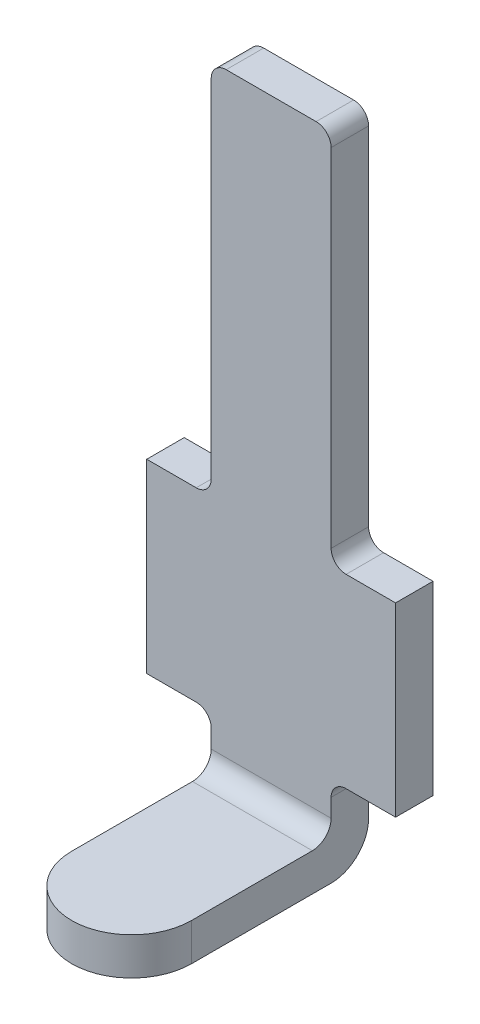
ISO-10303-21;
HEADER;
FILE_DESCRIPTION(('STEP AP214'),'2;1');
FILE_NAME('part.step','',(''),(''),'','','');
FILE_SCHEMA(('AUTOMOTIVE_DESIGN { 1 0 10303 214 1 1 1 1 }'));
ENDSEC;
DATA;
#1=APPLICATION_CONTEXT('core data for automotive mechanical design processes');
#2=APPLICATION_PROTOCOL_DEFINITION('international standard','automotive_design',2000,#1);
#3=PRODUCT_CONTEXT('',#1,'mechanical');
#4=PRODUCT('Part','Part','',(#3));
#5=PRODUCT_RELATED_PRODUCT_CATEGORY('part','',(#4));
#6=PRODUCT_DEFINITION_FORMATION('','',#4);
#7=PRODUCT_DEFINITION_CONTEXT('part definition',#1,'design');
#8=PRODUCT_DEFINITION('design','',#6,#7);
#9=PRODUCT_DEFINITION_SHAPE('','',#8);
#10=(LENGTH_UNIT() NAMED_UNIT(*) SI_UNIT(.MILLI.,.METRE.));
#11=(NAMED_UNIT(*) PLANE_ANGLE_UNIT() SI_UNIT($,.RADIAN.));
#12=(NAMED_UNIT(*) SI_UNIT($,.STERADIAN.) SOLID_ANGLE_UNIT());
#13=UNCERTAINTY_MEASURE_WITH_UNIT(LENGTH_MEASURE(1.E-05),#10,'distance_accuracy_value','');
#14=(GEOMETRIC_REPRESENTATION_CONTEXT(3) GLOBAL_UNCERTAINTY_ASSIGNED_CONTEXT((#13)) GLOBAL_UNIT_ASSIGNED_CONTEXT((#10,
#11,#12)) REPRESENTATION_CONTEXT('',''));
#15=CARTESIAN_POINT('',(0.,0.,0.));
#16=DIRECTION('',(0.,0.,1.));
#17=DIRECTION('',(1.,0.,0.));
#18=AXIS2_PLACEMENT_3D('',#15,#16,#17);
#19=CARTESIAN_POINT('',(-6.85,0.0459658151929143,0.749000000000012));
#20=DIRECTION('',(0.,0.,-1.));
#21=DIRECTION('',(-1.,0.,0.));
#22=AXIS2_PLACEMENT_3D('',#19,#20,#21);
#23=CYLINDRICAL_SURFACE('',#22,0.1);
#24=CARTESIAN_POINT('',(-6.85,0.0459658151929143,0.498999999999983));
#25=DIRECTION('',(0.,0.,1.));
#26=DIRECTION('',(1.,0.,0.));
#27=AXIS2_PLACEMENT_3D('',#24,#25,#26);
#28=CIRCLE('',#27,0.1);
#29=CARTESIAN_POINT('',(-6.75,0.0459658151929143,0.498999999999983));
#30=VERTEX_POINT('',#29);
#31=CARTESIAN_POINT('',(-6.85,0.145965815192914,0.499000000000012));
#32=VERTEX_POINT('',#31);
#33=EDGE_CURVE('E382',#30,#32,#28,.T.);
#34=ORIENTED_EDGE('',*,*,#33,.F.);
#35=DIRECTION('',(0.,0.,-1.));
#36=VECTOR('',#35,1.);
#37=CARTESIAN_POINT('',(-6.75,0.0459658151929143,0.499000000000012));
#38=LINE('',#37,#36);
#39=CARTESIAN_POINT('',(-6.75,0.0459658151929143,0.748999999999983));
#40=VERTEX_POINT('',#39);
#41=EDGE_CURVE('E383',#40,#30,#38,.T.);
#42=ORIENTED_EDGE('',*,*,#41,.F.);
#43=CARTESIAN_POINT('',(-6.85,0.0459658151929143,0.748999999999983));
#44=DIRECTION('',(0.,0.,-1.));
#45=DIRECTION('',(-1.,0.,0.));
#46=AXIS2_PLACEMENT_3D('',#43,#44,#45);
#47=CIRCLE('',#46,0.1);
#48=CARTESIAN_POINT('',(-6.85,0.145965815192914,0.749000000000012));
#49=VERTEX_POINT('',#48);
#50=EDGE_CURVE('E332',#49,#40,#47,.T.);
#51=ORIENTED_EDGE('',*,*,#50,.F.);
#52=DIRECTION('',(0.,0.,1.));
#53=VECTOR('',#52,1.);
#54=CARTESIAN_POINT('',(-6.85,0.145965815192914,0.748999999999983));
#55=LINE('',#54,#53);
#56=EDGE_CURVE('E305',#32,#49,#55,.T.);
#57=ORIENTED_EDGE('',*,*,#56,.F.);
#58=EDGE_LOOP('',(#34,#42,#51,#57));
#59=FACE_BOUND('',#58,.T.);
#60=ADVANCED_FACE('F16',(#59),#23,.F.);
#61=CARTESIAN_POINT('',(-5.85,0.0459658151929143,0.748999999999984));
#62=DIRECTION('',(0.,0.,1.));
#63=DIRECTION('',(1.,0.,0.));
#64=AXIS2_PLACEMENT_3D('',#61,#62,#63);
#65=CYLINDRICAL_SURFACE('',#64,0.1);
#66=CARTESIAN_POINT('',(-5.85,0.0459658151929143,0.498999999999984));
#67=DIRECTION('',(0.,0.,1.));
#68=DIRECTION('',(1.,0.,0.));
#69=AXIS2_PLACEMENT_3D('',#66,#67,#68);
#70=CIRCLE('',#69,0.1);
#71=CARTESIAN_POINT('',(-5.85,0.145965815192914,0.499000000000013));
#72=VERTEX_POINT('',#71);
#73=CARTESIAN_POINT('',(-5.95,0.0459658151929143,0.498999999999984));
#74=VERTEX_POINT('',#73);
#75=EDGE_CURVE('E330',#72,#74,#70,.T.);
#76=ORIENTED_EDGE('',*,*,#75,.F.);
#77=DIRECTION('',(0.,0.,-1.));
#78=VECTOR('',#77,1.);
#79=CARTESIAN_POINT('',(-5.85,0.145965815192914,0.749000000000013));
#80=LINE('',#79,#78);
#81=CARTESIAN_POINT('',(-5.85,0.145965815192914,0.749000000000013));
#82=VERTEX_POINT('',#81);
#83=EDGE_CURVE('E27',#82,#72,#80,.T.);
#84=ORIENTED_EDGE('',*,*,#83,.F.);
#85=CARTESIAN_POINT('',(-5.85,0.0459658151929143,0.748999999999984));
#86=DIRECTION('',(0.,0.,-1.));
#87=DIRECTION('',(-1.,0.,0.));
#88=AXIS2_PLACEMENT_3D('',#85,#86,#87);
#89=CIRCLE('',#88,0.1);
#90=CARTESIAN_POINT('',(-5.95,0.0459658151929143,0.748999999999984));
#91=VERTEX_POINT('',#90);
#92=EDGE_CURVE('E275',#91,#82,#89,.T.);
#93=ORIENTED_EDGE('',*,*,#92,.F.);
#94=DIRECTION('',(0.,0.,1.));
#95=VECTOR('',#94,1.);
#96=CARTESIAN_POINT('',(-5.95,0.0459658151929143,0.748999999999984));
#97=LINE('',#96,#95);
#98=EDGE_CURVE('E454',#74,#91,#97,.T.);
#99=ORIENTED_EDGE('',*,*,#98,.F.);
#100=EDGE_LOOP('',(#76,#84,#93,#99));
#101=FACE_BOUND('',#100,.T.);
#102=ADVANCED_FACE('F453',(#101),#65,.F.);
#103=CARTESIAN_POINT('',(-6.85,1.48437551370885,0.748999999999983));
#104=DIRECTION('',(0.,0.,1.));
#105=DIRECTION('',(1.,0.,0.));
#106=AXIS2_PLACEMENT_3D('',#103,#104,#105);
#107=CYLINDRICAL_SURFACE('',#106,0.1);
#108=CARTESIAN_POINT('',(-6.85,1.48437551370885,0.498999999999983));
#109=DIRECTION('',(0.,0.,1.));
#110=DIRECTION('',(1.,0.,0.));
#111=AXIS2_PLACEMENT_3D('',#108,#109,#110);
#112=CIRCLE('',#111,0.1);
#113=CARTESIAN_POINT('',(-6.85,1.38437551370885,0.499000000000012));
#114=VERTEX_POINT('',#113);
#115=CARTESIAN_POINT('',(-6.75,1.48437551370885,0.498999999999983));
#116=VERTEX_POINT('',#115);
#117=EDGE_CURVE('E416',#114,#116,#112,.T.);
#118=ORIENTED_EDGE('',*,*,#117,.F.);
#119=DIRECTION('',(0.,0.,-1.));
#120=VECTOR('',#119,1.);
#121=CARTESIAN_POINT('',(-6.85,1.38437551370885,0.749000000000012));
#122=LINE('',#121,#120);
#123=CARTESIAN_POINT('',(-6.85,1.38437551370885,0.749000000000012));
#124=VERTEX_POINT('',#123);
#125=EDGE_CURVE('E42',#124,#114,#122,.T.);
#126=ORIENTED_EDGE('',*,*,#125,.F.);
#127=CARTESIAN_POINT('',(-6.85,1.48437551370885,0.748999999999983));
#128=DIRECTION('',(0.,0.,-1.));
#129=DIRECTION('',(-1.,0.,0.));
#130=AXIS2_PLACEMENT_3D('',#127,#128,#129);
#131=CIRCLE('',#130,0.1);
#132=CARTESIAN_POINT('',(-6.75,1.48437551370885,0.748999999999983));
#133=VERTEX_POINT('',#132);
#134=EDGE_CURVE('E367',#133,#124,#131,.T.);
#135=ORIENTED_EDGE('',*,*,#134,.F.);
#136=DIRECTION('',(0.,0.,1.));
#137=VECTOR('',#136,1.);
#138=CARTESIAN_POINT('',(-6.75,1.48437551370885,0.748999999999983));
#139=LINE('',#138,#137);
#140=EDGE_CURVE('E394',#116,#133,#139,.T.);
#141=ORIENTED_EDGE('',*,*,#140,.F.);
#142=EDGE_LOOP('',(#118,#126,#135,#141));
#143=FACE_BOUND('',#142,.T.);
#144=ADVANCED_FACE('F515',(#143),#107,.F.);
#145=CARTESIAN_POINT('',(-5.85,1.48437551370885,0.749000000000014));
#146=DIRECTION('',(0.,0.,-1.));
#147=DIRECTION('',(-1.,0.,0.));
#148=AXIS2_PLACEMENT_3D('',#145,#146,#147);
#149=CYLINDRICAL_SURFACE('',#148,0.1);
#150=CARTESIAN_POINT('',(-5.85,1.48437551370885,0.498999999999985));
#151=DIRECTION('',(0.,0.,1.));
#152=DIRECTION('',(1.,0.,0.));
#153=AXIS2_PLACEMENT_3D('',#150,#151,#152);
#154=CIRCLE('',#153,0.1);
#155=CARTESIAN_POINT('',(-5.95,1.48437551370885,0.498999999999984));
#156=VERTEX_POINT('',#155);
#157=CARTESIAN_POINT('',(-5.85,1.38437551370885,0.499000000000013));
#158=VERTEX_POINT('',#157);
#159=EDGE_CURVE('E215',#156,#158,#154,.T.);
#160=ORIENTED_EDGE('',*,*,#159,.F.);
#161=DIRECTION('',(0.,0.,-1.));
#162=VECTOR('',#161,1.);
#163=CARTESIAN_POINT('',(-5.95,1.48437551370885,0.498999999999984));
#164=LINE('',#163,#162);
#165=CARTESIAN_POINT('',(-5.95,1.48437551370885,0.748999999999984));
#166=VERTEX_POINT('',#165);
#167=EDGE_CURVE('E219',#166,#156,#164,.T.);
#168=ORIENTED_EDGE('',*,*,#167,.F.);
#169=CARTESIAN_POINT('',(-5.85,1.48437551370885,0.748999999999984));
#170=DIRECTION('',(0.,0.,-1.));
#171=DIRECTION('',(-1.,0.,0.));
#172=AXIS2_PLACEMENT_3D('',#169,#170,#171);
#173=CIRCLE('',#172,0.1);
#174=CARTESIAN_POINT('',(-5.85,1.38437551370885,0.749000000000014));
#175=VERTEX_POINT('',#174);
#176=EDGE_CURVE('E272',#175,#166,#173,.T.);
#177=ORIENTED_EDGE('',*,*,#176,.F.);
#178=DIRECTION('',(0.,0.,1.));
#179=VECTOR('',#178,1.);
#180=CARTESIAN_POINT('',(-5.85,1.38437551370885,0.748999999999984));
#181=LINE('',#180,#179);
#182=EDGE_CURVE('E221',#158,#175,#181,.T.);
#183=ORIENTED_EDGE('',*,*,#182,.F.);
#184=EDGE_LOOP('',(#160,#168,#177,#183));
#185=FACE_BOUND('',#184,.T.);
#186=ADVANCED_FACE('F217',(#185),#149,.F.);
#187=CARTESIAN_POINT('',(-6.65,3.8,0.748999999999983));
#188=DIRECTION('',(0.,0.,-1.));
#189=DIRECTION('',(-1.,0.,0.));
#190=AXIS2_PLACEMENT_3D('',#187,#188,#189);
#191=CYLINDRICAL_SURFACE('',#190,0.1);
#192=CARTESIAN_POINT('',(-6.65,3.8,0.498999999999984));
#193=DIRECTION('',(0.,0.,-1.));
#194=DIRECTION('',(1.,0.,0.));
#195=AXIS2_PLACEMENT_3D('',#192,#193,#194);
#196=CIRCLE('',#195,0.1);
#197=CARTESIAN_POINT('',(-6.75,3.8,0.498999999999984));
#198=VERTEX_POINT('',#197);
#199=CARTESIAN_POINT('',(-6.65,3.9,0.498999999999984));
#200=VERTEX_POINT('',#199);
#201=EDGE_CURVE('E420',#198,#200,#196,.T.);
#202=ORIENTED_EDGE('',*,*,#201,.F.);
#203=DIRECTION('',(0.,0.,-1.));
#204=VECTOR('',#203,1.);
#205=CARTESIAN_POINT('',(-6.75,3.8,0.498999999999984));
#206=LINE('',#205,#204);
#207=CARTESIAN_POINT('',(-6.75,3.8,0.748999999999983));
#208=VERTEX_POINT('',#207);
#209=EDGE_CURVE('E395',#208,#198,#206,.T.);
#210=ORIENTED_EDGE('',*,*,#209,.F.);
#211=CARTESIAN_POINT('',(-6.65,3.8,0.748999999999983));
#212=DIRECTION('',(0.,0.,1.));
#213=DIRECTION('',(-1.,0.,0.));
#214=AXIS2_PLACEMENT_3D('',#211,#212,#213);
#215=CIRCLE('',#214,0.1);
#216=CARTESIAN_POINT('',(-6.65,3.9,0.748999999999983));
#217=VERTEX_POINT('',#216);
#218=EDGE_CURVE('E289',#217,#208,#215,.T.);
#219=ORIENTED_EDGE('',*,*,#218,.F.);
#220=DIRECTION('',(0.,0.,1.));
#221=VECTOR('',#220,1.);
#222=CARTESIAN_POINT('',(-6.65,3.9,0.748999999999983));
#223=LINE('',#222,#221);
#224=EDGE_CURVE('E320',#200,#217,#223,.T.);
#225=ORIENTED_EDGE('',*,*,#224,.F.);
#226=EDGE_LOOP('',(#202,#210,#219,#225));
#227=FACE_BOUND('',#226,.T.);
#228=ADVANCED_FACE('F563',(#227),#191,.T.);
#229=CARTESIAN_POINT('',(-6.05,3.8,0.748999999999984));
#230=DIRECTION('',(0.,0.,1.));
#231=DIRECTION('',(1.,0.,0.));
#232=AXIS2_PLACEMENT_3D('',#229,#230,#231);
#233=CYLINDRICAL_SURFACE('',#232,0.1);
#234=CARTESIAN_POINT('',(-6.05,3.8,0.498999999999985));
#235=DIRECTION('',(0.,0.,-1.));
#236=DIRECTION('',(1.,0.,0.));
#237=AXIS2_PLACEMENT_3D('',#234,#235,#236);
#238=CIRCLE('',#237,0.1);
#239=CARTESIAN_POINT('',(-6.05,3.9,0.498999999999985));
#240=VERTEX_POINT('',#239);
#241=CARTESIAN_POINT('',(-5.95,3.8,0.498999999999985));
#242=VERTEX_POINT('',#241);
#243=EDGE_CURVE('E228',#240,#242,#238,.T.);
#244=ORIENTED_EDGE('',*,*,#243,.F.);
#245=DIRECTION('',(0.,0.,-1.));
#246=VECTOR('',#245,1.);
#247=CARTESIAN_POINT('',(-6.05,3.9,0.748999999999984));
#248=LINE('',#247,#246);
#249=CARTESIAN_POINT('',(-6.05,3.9,0.748999999999984));
#250=VERTEX_POINT('',#249);
#251=EDGE_CURVE('E363',#250,#240,#248,.T.);
#252=ORIENTED_EDGE('',*,*,#251,.F.);
#253=CARTESIAN_POINT('',(-6.05,3.8,0.748999999999984));
#254=DIRECTION('',(0.,0.,1.));
#255=DIRECTION('',(-1.,0.,0.));
#256=AXIS2_PLACEMENT_3D('',#253,#254,#255);
#257=CIRCLE('',#256,0.1);
#258=CARTESIAN_POINT('',(-5.95,3.8,0.748999999999984));
#259=VERTEX_POINT('',#258);
#260=EDGE_CURVE('E323',#259,#250,#257,.T.);
#261=ORIENTED_EDGE('',*,*,#260,.F.);
#262=DIRECTION('',(0.,0.,1.));
#263=VECTOR('',#262,1.);
#264=CARTESIAN_POINT('',(-5.95,3.8,0.748999999999984));
#265=LINE('',#264,#263);
#266=EDGE_CURVE('E244',#242,#259,#265,.T.);
#267=ORIENTED_EDGE('',*,*,#266,.F.);
#268=EDGE_LOOP('',(#244,#252,#261,#267));
#269=FACE_BOUND('',#268,.T.);
#270=ADVANCED_FACE('F18',(#269),#233,.T.);
#271=CARTESIAN_POINT('',(-5.52,0.,1.00308650274883E-13));
#272=DIRECTION('',(-1.,0.,0.));
#273=DIRECTION('',(0.,0.,1.));
#274=AXIS2_PLACEMENT_3D('',#271,#272,#273);
#275=PLANE('',#274);
#276=DIRECTION('',(0.,0.,-1.));
#277=VECTOR('',#276,1.);
#278=CARTESIAN_POINT('',(-5.52,1.38437551370885,0.749000000000014));
#279=LINE('',#278,#277);
#280=CARTESIAN_POINT('',(-5.52,1.38437551370885,0.749000000000014));
#281=VERTEX_POINT('',#280);
#282=CARTESIAN_POINT('',(-5.52,1.38437551370885,0.499000000000014));
#283=VERTEX_POINT('',#282);
#284=EDGE_CURVE('E292',#281,#283,#279,.T.);
#285=ORIENTED_EDGE('',*,*,#284,.F.);
#286=DIRECTION('',(0.,-1.,0.));
#287=VECTOR('',#286,1.);
#288=CARTESIAN_POINT('',(-5.52,1.38437551370885,0.749000000000014));
#289=LINE('',#288,#287);
#290=CARTESIAN_POINT('',(-5.52,0.145965815192914,0.749000000000014));
#291=VERTEX_POINT('',#290);
#292=EDGE_CURVE('E259',#281,#291,#289,.T.);
#293=ORIENTED_EDGE('',*,*,#292,.T.);
#294=DIRECTION('',(0.,0.,-1.));
#295=VECTOR('',#294,1.);
#296=CARTESIAN_POINT('',(-5.52,0.145965815192914,0.749000000000014));
#297=LINE('',#296,#295);
#298=CARTESIAN_POINT('',(-5.52,0.145965815192914,0.499000000000014));
#299=VERTEX_POINT('',#298);
#300=EDGE_CURVE('E11',#291,#299,#297,.T.);
#301=ORIENTED_EDGE('',*,*,#300,.T.);
#302=DIRECTION('',(0.,-1.,0.));
#303=VECTOR('',#302,1.);
#304=CARTESIAN_POINT('',(-5.52,1.38437551370885,0.499000000000014));
#305=LINE('',#304,#303);
#306=EDGE_CURVE('E331',#283,#299,#305,.T.);
#307=ORIENTED_EDGE('',*,*,#306,.F.);
#308=EDGE_LOOP('',(#285,#293,#301,#307));
#309=FACE_BOUND('',#308,.T.);
#310=ADVANCED_FACE('F447',(#309),#275,.F.);
#311=CARTESIAN_POINT('',(-7.18,0.145965815192914,0.749000000000011));
#312=DIRECTION('',(0.,-1.,0.));
#313=DIRECTION('',(0.,0.,-1.));
#314=AXIS2_PLACEMENT_3D('',#311,#312,#313);
#315=PLANE('',#314);
#316=DIRECTION('',(1.,0.,0.));
#317=VECTOR('',#316,1.);
#318=CARTESIAN_POINT('',(-7.18,0.145965815192914,0.749000000000011));
#319=LINE('',#318,#317);
#320=EDGE_CURVE('E263',#82,#291,#319,.T.);
#321=ORIENTED_EDGE('',*,*,#320,.F.);
#322=ORIENTED_EDGE('',*,*,#83,.T.);
#323=DIRECTION('',(1.,0.,0.));
#324=VECTOR('',#323,1.);
#325=CARTESIAN_POINT('',(-7.18,0.145965815192914,0.499000000000011));
#326=LINE('',#325,#324);
#327=EDGE_CURVE('E326',#72,#299,#326,.T.);
#328=ORIENTED_EDGE('',*,*,#327,.T.);
#329=ORIENTED_EDGE('',*,*,#300,.F.);
#330=EDGE_LOOP('',(#321,#322,#328,#329));
#331=FACE_BOUND('',#330,.T.);
#332=ADVANCED_FACE('F449',(#331),#315,.T.);
#333=CARTESIAN_POINT('',(-7.18,1.38437551370885,0.749000000000012));
#334=DIRECTION('',(0.,-1.,0.));
#335=DIRECTION('',(0.,0.,-1.));
#336=AXIS2_PLACEMENT_3D('',#333,#334,#335);
#337=PLANE('',#336);
#338=DIRECTION('',(1.,0.,0.));
#339=VECTOR('',#338,1.);
#340=CARTESIAN_POINT('',(-7.18,1.38437551370885,0.499000000000011));
#341=LINE('',#340,#339);
#342=EDGE_CURVE('E227',#158,#283,#341,.T.);
#343=ORIENTED_EDGE('',*,*,#342,.F.);
#344=ORIENTED_EDGE('',*,*,#182,.T.);
#345=DIRECTION('',(1.,0.,0.));
#346=VECTOR('',#345,1.);
#347=CARTESIAN_POINT('',(-7.18,1.38437551370885,0.749000000000012));
#348=LINE('',#347,#346);
#349=EDGE_CURVE('E262',#175,#281,#348,.T.);
#350=ORIENTED_EDGE('',*,*,#349,.T.);
#351=ORIENTED_EDGE('',*,*,#284,.T.);
#352=EDGE_LOOP('',(#343,#344,#350,#351));
#353=FACE_BOUND('',#352,.T.);
#354=ADVANCED_FACE('F444',(#353),#337,.F.);
#355=CARTESIAN_POINT('',(-7.18,1.38437551370885,0.749000000000012));
#356=DIRECTION('',(0.,-1.,0.));
#357=DIRECTION('',(0.,0.,-1.));
#358=AXIS2_PLACEMENT_3D('',#355,#356,#357);
#359=PLANE('',#358);
#360=DIRECTION('',(1.,0.,0.));
#361=VECTOR('',#360,1.);
#362=CARTESIAN_POINT('',(-7.18,1.38437551370885,0.749000000000012));
#363=LINE('',#362,#361);
#364=CARTESIAN_POINT('',(-7.18,1.38437551370885,0.749000000000012));
#365=VERTEX_POINT('',#364);
#366=EDGE_CURVE('E364',#365,#124,#363,.T.);
#367=ORIENTED_EDGE('',*,*,#366,.T.);
#368=ORIENTED_EDGE('',*,*,#125,.T.);
#369=DIRECTION('',(1.,0.,0.));
#370=VECTOR('',#369,1.);
#371=CARTESIAN_POINT('',(-7.18,1.38437551370885,0.499000000000011));
#372=LINE('',#371,#370);
#373=CARTESIAN_POINT('',(-7.18,1.38437551370885,0.499000000000011));
#374=VERTEX_POINT('',#373);
#375=EDGE_CURVE('E303',#374,#114,#372,.T.);
#376=ORIENTED_EDGE('',*,*,#375,.F.);
#377=DIRECTION('',(0.,0.,-1.));
#378=VECTOR('',#377,1.);
#379=CARTESIAN_POINT('',(-7.18,1.38437551370885,0.749000000000012));
#380=LINE('',#379,#378);
#381=EDGE_CURVE('E408',#365,#374,#380,.T.);
#382=ORIENTED_EDGE('',*,*,#381,.F.);
#383=EDGE_LOOP('',(#367,#368,#376,#382));
#384=FACE_BOUND('',#383,.T.);
#385=ADVANCED_FACE('F498',(#384),#359,.F.);
#386=CARTESIAN_POINT('',(-7.18,0.145965815192914,0.749000000000011));
#387=DIRECTION('',(0.,-1.,0.));
#388=DIRECTION('',(0.,0.,-1.));
#389=AXIS2_PLACEMENT_3D('',#386,#387,#388);
#390=PLANE('',#389);
#391=DIRECTION('',(1.,0.,0.));
#392=VECTOR('',#391,1.);
#393=CARTESIAN_POINT('',(-7.18,0.145965815192914,0.499000000000011));
#394=LINE('',#393,#392);
#395=CARTESIAN_POINT('',(-7.18,0.145965815192914,0.499000000000011));
#396=VERTEX_POINT('',#395);
#397=EDGE_CURVE('E304',#396,#32,#394,.T.);
#398=ORIENTED_EDGE('',*,*,#397,.T.);
#399=ORIENTED_EDGE('',*,*,#56,.T.);
#400=DIRECTION('',(1.,0.,0.));
#401=VECTOR('',#400,1.);
#402=CARTESIAN_POINT('',(-7.18,0.145965815192914,0.749000000000011));
#403=LINE('',#402,#401);
#404=CARTESIAN_POINT('',(-7.18,0.145965815192914,0.749000000000011));
#405=VERTEX_POINT('',#404);
#406=EDGE_CURVE('E337',#405,#49,#403,.T.);
#407=ORIENTED_EDGE('',*,*,#406,.F.);
#408=DIRECTION('',(0.,0.,-1.));
#409=VECTOR('',#408,1.);
#410=CARTESIAN_POINT('',(-7.18,0.145965815192914,0.749000000000011));
#411=LINE('',#410,#409);
#412=EDGE_CURVE('E308',#405,#396,#411,.T.);
#413=ORIENTED_EDGE('',*,*,#412,.T.);
#414=EDGE_LOOP('',(#398,#399,#407,#413));
#415=FACE_BOUND('',#414,.T.);
#416=ADVANCED_FACE('F488',(#415),#390,.T.);
#417=CARTESIAN_POINT('',(-7.18,0.,0.));
#418=DIRECTION('',(-1.,0.,0.));
#419=DIRECTION('',(0.,0.,1.));
#420=AXIS2_PLACEMENT_3D('',#417,#418,#419);
#421=PLANE('',#420);
#422=ORIENTED_EDGE('',*,*,#381,.T.);
#423=DIRECTION('',(0.,-1.,0.));
#424=VECTOR('',#423,1.);
#425=CARTESIAN_POINT('',(-7.18,1.38437551370885,0.499000000000011));
#426=LINE('',#425,#424);
#427=EDGE_CURVE('E299',#374,#396,#426,.T.);
#428=ORIENTED_EDGE('',*,*,#427,.T.);
#429=ORIENTED_EDGE('',*,*,#412,.F.);
#430=DIRECTION('',(0.,-1.,0.));
#431=VECTOR('',#430,1.);
#432=CARTESIAN_POINT('',(-7.18,1.38437551370885,0.749000000000012));
#433=LINE('',#432,#431);
#434=EDGE_CURVE('E340',#365,#405,#433,.T.);
#435=ORIENTED_EDGE('',*,*,#434,.F.);
#436=EDGE_LOOP('',(#422,#428,#429,#435));
#437=FACE_BOUND('',#436,.T.);
#438=ADVANCED_FACE('F492',(#437),#421,.T.);
#439=CARTESIAN_POINT('',(-6.35,-0.2,1.68));
#440=DIRECTION('',(0.,-1.,0.));
#441=DIRECTION('',(0.,0.,-1.));
#442=AXIS2_PLACEMENT_3D('',#439,#440,#441);
#443=CYLINDRICAL_SURFACE('',#442,0.4);
#444=DIRECTION('',(0.,-1.,0.));
#445=VECTOR('',#444,1.);
#446=CARTESIAN_POINT('',(-5.95,-0.2,1.68));
#447=LINE('',#446,#445);
#448=CARTESIAN_POINT('',(-5.95,-0.2,1.68));
#449=VERTEX_POINT('',#448);
#450=CARTESIAN_POINT('',(-5.95,-0.45,1.68));
#451=VERTEX_POINT('',#450);
#452=EDGE_CURVE('E191',#449,#451,#447,.T.);
#453=ORIENTED_EDGE('',*,*,#452,.F.);
#454=CARTESIAN_POINT('',(-6.35,-0.2,1.68));
#455=DIRECTION('',(0.,1.,0.));
#456=DIRECTION('',(0.,0.,-1.));
#457=AXIS2_PLACEMENT_3D('',#454,#455,#456);
#458=CIRCLE('',#457,0.4);
#459=CARTESIAN_POINT('',(-6.75,-0.2,1.68));
#460=VERTEX_POINT('',#459);
#461=EDGE_CURVE('E297',#460,#449,#458,.T.);
#462=ORIENTED_EDGE('',*,*,#461,.F.);
#463=DIRECTION('',(0.,1.,0.));
#464=VECTOR('',#463,1.);
#465=CARTESIAN_POINT('',(-6.75,-0.2,1.68));
#466=LINE('',#465,#464);
#467=CARTESIAN_POINT('',(-6.75,-0.45,1.68));
#468=VERTEX_POINT('',#467);
#469=EDGE_CURVE('E203',#468,#460,#466,.T.);
#470=ORIENTED_EDGE('',*,*,#469,.F.);
#471=CARTESIAN_POINT('',(-6.35,-0.45,1.68));
#472=DIRECTION('',(0.,-1.,0.));
#473=DIRECTION('',(0.,0.,1.));
#474=AXIS2_PLACEMENT_3D('',#471,#472,#473);
#475=CIRCLE('',#474,0.4);
#476=EDGE_CURVE('E255',#451,#468,#475,.T.);
#477=ORIENTED_EDGE('',*,*,#476,.F.);
#478=EDGE_LOOP('',(#453,#462,#470,#477));
#479=FACE_BOUND('',#478,.T.);
#480=ADVANCED_FACE('F535',(#479),#443,.T.);
#481=CARTESIAN_POINT('',(-6.75,-0.2,0.748999999999983));
#482=DIRECTION('',(-1.,0.,0.));
#483=DIRECTION('',(0.,0.,1.));
#484=AXIS2_PLACEMENT_3D('',#481,#482,#483);
#485=PLANE('',#484);
#486=DIRECTION('',(0.,-1.,0.));
#487=VECTOR('',#486,1.);
#488=CARTESIAN_POINT('',(-6.75,3.9,0.748999999999983));
#489=LINE('',#488,#487);
#490=CARTESIAN_POINT('',(-6.75,-0.0749999999999988,0.748999999999983));
#491=VERTEX_POINT('',#490);
#492=EDGE_CURVE('E336',#40,#491,#489,.T.);
#493=ORIENTED_EDGE('',*,*,#492,.F.);
#494=ORIENTED_EDGE('',*,*,#41,.T.);
#495=DIRECTION('',(0.,1.,0.));
#496=VECTOR('',#495,1.);
#497=CARTESIAN_POINT('',(-6.75,3.9,0.498999999999984));
#498=LINE('',#497,#496);
#499=CARTESIAN_POINT('',(-6.75,-0.2,0.498999999999983));
#500=VERTEX_POINT('',#499);
#501=EDGE_CURVE('E20',#500,#30,#498,.T.);
#502=ORIENTED_EDGE('',*,*,#501,.F.);
#503=CARTESIAN_POINT('',(-6.75,-0.2,0.748999999999983));
#504=DIRECTION('',(1.,0.,0.));
#505=DIRECTION('',(0.,0.,1.));
#506=AXIS2_PLACEMENT_3D('',#503,#504,#505);
#507=CIRCLE('',#506,0.25);
#508=CARTESIAN_POINT('',(-6.75,-0.45,0.748999999999983));
#509=VERTEX_POINT('',#508);
#510=EDGE_CURVE('E359',#509,#500,#507,.T.);
#511=ORIENTED_EDGE('',*,*,#510,.F.);
#512=DIRECTION('',(0.,0.,-1.));
#513=VECTOR('',#512,1.);
#514=CARTESIAN_POINT('',(-6.75,-0.45,0.748999999999983));
#515=LINE('',#514,#513);
#516=EDGE_CURVE('E257',#468,#509,#515,.T.);
#517=ORIENTED_EDGE('',*,*,#516,.F.);
#518=ORIENTED_EDGE('',*,*,#469,.T.);
#519=DIRECTION('',(0.,0.,1.));
#520=VECTOR('',#519,1.);
#521=CARTESIAN_POINT('',(-6.75,-0.2,0.873999999999983));
#522=LINE('',#521,#520);
#523=CARTESIAN_POINT('',(-6.75,-0.2,0.873999999999983));
#524=VERTEX_POINT('',#523);
#525=EDGE_CURVE('E293',#524,#460,#522,.T.);
#526=ORIENTED_EDGE('',*,*,#525,.F.);
#527=CARTESIAN_POINT('',(-6.75,-0.0749999999999988,0.873999999999983));
#528=DIRECTION('',(-1.,0.,0.));
#529=DIRECTION('',(0.,0.,1.));
#530=AXIS2_PLACEMENT_3D('',#527,#528,#529);
#531=CIRCLE('',#530,0.125);
#532=EDGE_CURVE('E309',#491,#524,#531,.T.);
#533=ORIENTED_EDGE('',*,*,#532,.F.);
#534=EDGE_LOOP('',(#493,#494,#502,#511,#517,#518,#526,#533));
#535=FACE_BOUND('',#534,.T.);
#536=ADVANCED_FACE('F481',(#535),#485,.T.);
#537=CARTESIAN_POINT('',(-5.95,-0.2,0.748999999999984));
#538=DIRECTION('',(-1.,0.,0.));
#539=DIRECTION('',(0.,0.,1.));
#540=AXIS2_PLACEMENT_3D('',#537,#538,#539);
#541=PLANE('',#540);
#542=DIRECTION('',(0.,1.,0.));
#543=VECTOR('',#542,1.);
#544=CARTESIAN_POINT('',(-5.95,3.9,0.498999999999985));
#545=LINE('',#544,#543);
#546=CARTESIAN_POINT('',(-5.95,-0.2,0.498999999999984));
#547=VERTEX_POINT('',#546);
#548=EDGE_CURVE('E386',#547,#74,#545,.T.);
#549=ORIENTED_EDGE('',*,*,#548,.T.);
#550=ORIENTED_EDGE('',*,*,#98,.T.);
#551=DIRECTION('',(0.,-1.,0.));
#552=VECTOR('',#551,1.);
#553=CARTESIAN_POINT('',(-5.95,3.9,0.748999999999984));
#554=LINE('',#553,#552);
#555=CARTESIAN_POINT('',(-5.95,-0.0749999999999988,0.748999999999984));
#556=VERTEX_POINT('',#555);
#557=EDGE_CURVE('E285',#91,#556,#554,.T.);
#558=ORIENTED_EDGE('',*,*,#557,.T.);
#559=CARTESIAN_POINT('',(-5.95,-0.0749999999999988,0.873999999999984));
#560=DIRECTION('',(-1.,0.,0.));
#561=DIRECTION('',(0.,0.,1.));
#562=AXIS2_PLACEMENT_3D('',#559,#560,#561);
#563=CIRCLE('',#562,0.125);
#564=CARTESIAN_POINT('',(-5.95,-0.2,0.873999999999984));
#565=VERTEX_POINT('',#564);
#566=EDGE_CURVE('E298',#556,#565,#563,.T.);
#567=ORIENTED_EDGE('',*,*,#566,.T.);
#568=DIRECTION('',(0.,0.,1.));
#569=VECTOR('',#568,1.);
#570=CARTESIAN_POINT('',(-5.95,-0.2,0.873999999999984));
#571=LINE('',#570,#569);
#572=EDGE_CURVE('E258',#565,#449,#571,.T.);
#573=ORIENTED_EDGE('',*,*,#572,.T.);
#574=ORIENTED_EDGE('',*,*,#452,.T.);
#575=DIRECTION('',(0.,0.,-1.));
#576=VECTOR('',#575,1.);
#577=CARTESIAN_POINT('',(-5.95,-0.45,0.748999999999984));
#578=LINE('',#577,#576);
#579=CARTESIAN_POINT('',(-5.95,-0.45,0.748999999999984));
#580=VERTEX_POINT('',#579);
#581=EDGE_CURVE('E433',#451,#580,#578,.T.);
#582=ORIENTED_EDGE('',*,*,#581,.T.);
#583=CARTESIAN_POINT('',(-5.95,-0.2,0.748999999999984));
#584=DIRECTION('',(1.,0.,0.));
#585=DIRECTION('',(0.,0.,1.));
#586=AXIS2_PLACEMENT_3D('',#583,#584,#585);
#587=CIRCLE('',#586,0.25);
#588=EDGE_CURVE('E358',#580,#547,#587,.T.);
#589=ORIENTED_EDGE('',*,*,#588,.T.);
#590=EDGE_LOOP('',(#549,#550,#558,#567,#573,#574,#582,#589));
#591=FACE_BOUND('',#590,.T.);
#592=ADVANCED_FACE('F458',(#591),#541,.F.);
#593=CARTESIAN_POINT('',(-5.95,3.9,0.498999999999985));
#594=DIRECTION('',(0.,0.,1.));
#595=DIRECTION('',(1.,0.,0.));
#596=AXIS2_PLACEMENT_3D('',#593,#594,#595);
#597=PLANE('',#596);
#598=DIRECTION('',(-1.,0.,0.));
#599=VECTOR('',#598,1.);
#600=CARTESIAN_POINT('',(-5.95,3.9,0.498999999999985));
#601=LINE('',#600,#599);
#602=EDGE_CURVE('E324',#240,#200,#601,.T.);
#603=ORIENTED_EDGE('',*,*,#602,.F.);
#604=ORIENTED_EDGE('',*,*,#243,.T.);
#605=DIRECTION('',(0.,1.,0.));
#606=VECTOR('',#605,1.);
#607=CARTESIAN_POINT('',(-5.95,3.9,0.498999999999985));
#608=LINE('',#607,#606);
#609=EDGE_CURVE('E234',#156,#242,#608,.T.);
#610=ORIENTED_EDGE('',*,*,#609,.F.);
#611=ORIENTED_EDGE('',*,*,#159,.T.);
#612=ORIENTED_EDGE('',*,*,#342,.T.);
#613=ORIENTED_EDGE('',*,*,#306,.T.);
#614=ORIENTED_EDGE('',*,*,#327,.F.);
#615=ORIENTED_EDGE('',*,*,#75,.T.);
#616=ORIENTED_EDGE('',*,*,#548,.F.);
#617=DIRECTION('',(-1.,0.,0.));
#618=VECTOR('',#617,1.);
#619=CARTESIAN_POINT('',(-5.95,-0.2,0.498999999999984));
#620=LINE('',#619,#618);
#621=EDGE_CURVE('E355',#547,#500,#620,.T.);
#622=ORIENTED_EDGE('',*,*,#621,.T.);
#623=ORIENTED_EDGE('',*,*,#501,.T.);
#624=ORIENTED_EDGE('',*,*,#33,.T.);
#625=ORIENTED_EDGE('',*,*,#397,.F.);
#626=ORIENTED_EDGE('',*,*,#427,.F.);
#627=ORIENTED_EDGE('',*,*,#375,.T.);
#628=ORIENTED_EDGE('',*,*,#117,.T.);
#629=DIRECTION('',(0.,1.,0.));
#630=VECTOR('',#629,1.);
#631=CARTESIAN_POINT('',(-6.75,3.9,0.498999999999984));
#632=LINE('',#631,#630);
#633=EDGE_CURVE('E390',#116,#198,#632,.T.);
#634=ORIENTED_EDGE('',*,*,#633,.T.);
#635=ORIENTED_EDGE('',*,*,#201,.T.);
#636=EDGE_LOOP('',(#603,#604,#610,#611,#612,#613,#614,#615,#616,#622,#623,#624,#625,#626,#627,
#628,#634,#635));
#637=FACE_BOUND('',#636,.T.);
#638=ADVANCED_FACE('F241',(#637),#597,.F.);
#639=CARTESIAN_POINT('',(-5.95,-0.2,0.748999999999984));
#640=DIRECTION('',(-1.,0.,0.));
#641=DIRECTION('',(0.,0.,1.));
#642=AXIS2_PLACEMENT_3D('',#639,#640,#641);
#643=CYLINDRICAL_SURFACE('',#642,0.25);
#644=ORIENTED_EDGE('',*,*,#510,.T.);
#645=ORIENTED_EDGE('',*,*,#621,.F.);
#646=ORIENTED_EDGE('',*,*,#588,.F.);
#647=DIRECTION('',(-1.,0.,0.));
#648=VECTOR('',#647,1.);
#649=CARTESIAN_POINT('',(-5.95,-0.45,0.748999999999984));
#650=LINE('',#649,#648);
#651=EDGE_CURVE('E402',#580,#509,#650,.T.);
#652=ORIENTED_EDGE('',*,*,#651,.T.);
#653=EDGE_LOOP('',(#644,#645,#646,#652));
#654=FACE_BOUND('',#653,.T.);
#655=ADVANCED_FACE('F462',(#654),#643,.T.);
#656=CARTESIAN_POINT('',(-5.95,-0.45,0.748999999999984));
#657=DIRECTION('',(0.,1.,0.));
#658=DIRECTION('',(0.,0.,-1.));
#659=AXIS2_PLACEMENT_3D('',#656,#657,#658);
#660=PLANE('',#659);
#661=ORIENTED_EDGE('',*,*,#476,.T.);
#662=ORIENTED_EDGE('',*,*,#516,.T.);
#663=ORIENTED_EDGE('',*,*,#651,.F.);
#664=ORIENTED_EDGE('',*,*,#581,.F.);
#665=EDGE_LOOP('',(#661,#662,#663,#664));
#666=FACE_BOUND('',#665,.T.);
#667=ADVANCED_FACE('F529',(#666),#660,.F.);
#668=CARTESIAN_POINT('',(-5.95,-0.2,0.873999999999984));
#669=DIRECTION('',(0.,-1.,0.));
#670=DIRECTION('',(0.,0.,-1.));
#671=AXIS2_PLACEMENT_3D('',#668,#669,#670);
#672=PLANE('',#671);
#673=ORIENTED_EDGE('',*,*,#525,.T.);
#674=ORIENTED_EDGE('',*,*,#461,.T.);
#675=ORIENTED_EDGE('',*,*,#572,.F.);
#676=DIRECTION('',(-1.,0.,0.));
#677=VECTOR('',#676,1.);
#678=CARTESIAN_POINT('',(-5.95,-0.2,0.873999999999984));
#679=LINE('',#678,#677);
#680=EDGE_CURVE('E313',#565,#524,#679,.T.);
#681=ORIENTED_EDGE('',*,*,#680,.T.);
#682=EDGE_LOOP('',(#673,#674,#675,#681));
#683=FACE_BOUND('',#682,.T.);
#684=ADVANCED_FACE('F527',(#683),#672,.F.);
#685=CARTESIAN_POINT('',(-5.95,-0.0749999999999988,0.873999999999984));
#686=DIRECTION('',(-1.,0.,0.));
#687=DIRECTION('',(0.,0.,1.));
#688=AXIS2_PLACEMENT_3D('',#685,#686,#687);
#689=CYLINDRICAL_SURFACE('',#688,0.125);
#690=ORIENTED_EDGE('',*,*,#532,.T.);
#691=ORIENTED_EDGE('',*,*,#680,.F.);
#692=ORIENTED_EDGE('',*,*,#566,.F.);
#693=DIRECTION('',(-1.,0.,0.));
#694=VECTOR('',#693,1.);
#695=CARTESIAN_POINT('',(-5.95,-0.0749999999999988,0.748999999999984));
#696=LINE('',#695,#694);
#697=EDGE_CURVE('E370',#556,#491,#696,.T.);
#698=ORIENTED_EDGE('',*,*,#697,.T.);
#699=EDGE_LOOP('',(#690,#691,#692,#698));
#700=FACE_BOUND('',#699,.T.);
#701=ADVANCED_FACE('F524',(#700),#689,.F.);
#702=CARTESIAN_POINT('',(-5.95,3.9,0.748999999999984));
#703=DIRECTION('',(0.,0.,-1.));
#704=DIRECTION('',(0.,-1.,0.));
#705=AXIS2_PLACEMENT_3D('',#702,#703,#704);
#706=PLANE('',#705);
#707=DIRECTION('',(0.,-1.,0.));
#708=VECTOR('',#707,1.);
#709=CARTESIAN_POINT('',(-5.95,3.9,0.748999999999984));
#710=LINE('',#709,#708);
#711=EDGE_CURVE('E236',#259,#166,#710,.T.);
#712=ORIENTED_EDGE('',*,*,#711,.F.);
#713=ORIENTED_EDGE('',*,*,#260,.T.);
#714=DIRECTION('',(-1.,0.,0.));
#715=VECTOR('',#714,1.);
#716=CARTESIAN_POINT('',(-5.95,3.9,0.748999999999984));
#717=LINE('',#716,#715);
#718=EDGE_CURVE('E425',#250,#217,#717,.T.);
#719=ORIENTED_EDGE('',*,*,#718,.T.);
#720=ORIENTED_EDGE('',*,*,#218,.T.);
#721=DIRECTION('',(0.,-1.,0.));
#722=VECTOR('',#721,1.);
#723=CARTESIAN_POINT('',(-6.75,3.9,0.748999999999983));
#724=LINE('',#723,#722);
#725=EDGE_CURVE('E238',#208,#133,#724,.T.);
#726=ORIENTED_EDGE('',*,*,#725,.T.);
#727=ORIENTED_EDGE('',*,*,#134,.T.);
#728=ORIENTED_EDGE('',*,*,#366,.F.);
#729=ORIENTED_EDGE('',*,*,#434,.T.);
#730=ORIENTED_EDGE('',*,*,#406,.T.);
#731=ORIENTED_EDGE('',*,*,#50,.T.);
#732=ORIENTED_EDGE('',*,*,#492,.T.);
#733=ORIENTED_EDGE('',*,*,#697,.F.);
#734=ORIENTED_EDGE('',*,*,#557,.F.);
#735=ORIENTED_EDGE('',*,*,#92,.T.);
#736=ORIENTED_EDGE('',*,*,#320,.T.);
#737=ORIENTED_EDGE('',*,*,#292,.F.);
#738=ORIENTED_EDGE('',*,*,#349,.F.);
#739=ORIENTED_EDGE('',*,*,#176,.T.);
#740=EDGE_LOOP('',(#712,#713,#719,#720,#726,#727,#728,#729,#730,#731,#732,#733,#734,#735,#736,
#737,#738,#739));
#741=FACE_BOUND('',#740,.T.);
#742=ADVANCED_FACE('F442',(#741),#706,.F.);
#743=CARTESIAN_POINT('',(-5.95,3.9,0.748999999999984));
#744=DIRECTION('',(0.,-1.,0.));
#745=DIRECTION('',(0.,0.,-1.));
#746=AXIS2_PLACEMENT_3D('',#743,#744,#745);
#747=PLANE('',#746);
#748=ORIENTED_EDGE('',*,*,#718,.F.);
#749=ORIENTED_EDGE('',*,*,#251,.T.);
#750=ORIENTED_EDGE('',*,*,#602,.T.);
#751=ORIENTED_EDGE('',*,*,#224,.T.);
#752=EDGE_LOOP('',(#748,#749,#750,#751));
#753=FACE_BOUND('',#752,.T.);
#754=ADVANCED_FACE('F519',(#753),#747,.F.);
#755=CARTESIAN_POINT('',(-6.75,-0.2,0.748999999999983));
#756=DIRECTION('',(-1.,0.,0.));
#757=DIRECTION('',(0.,0.,1.));
#758=AXIS2_PLACEMENT_3D('',#755,#756,#757);
#759=PLANE('',#758);
#760=ORIENTED_EDGE('',*,*,#725,.F.);
#761=ORIENTED_EDGE('',*,*,#209,.T.);
#762=ORIENTED_EDGE('',*,*,#633,.F.);
#763=ORIENTED_EDGE('',*,*,#140,.T.);
#764=EDGE_LOOP('',(#760,#761,#762,#763));
#765=FACE_BOUND('',#764,.T.);
#766=ADVANCED_FACE('F522',(#765),#759,.T.);
#767=CARTESIAN_POINT('',(-5.95,-0.2,0.748999999999984));
#768=DIRECTION('',(-1.,0.,0.));
#769=DIRECTION('',(0.,0.,1.));
#770=AXIS2_PLACEMENT_3D('',#767,#768,#769);
#771=PLANE('',#770);
#772=ORIENTED_EDGE('',*,*,#609,.T.);
#773=ORIENTED_EDGE('',*,*,#266,.T.);
#774=ORIENTED_EDGE('',*,*,#711,.T.);
#775=ORIENTED_EDGE('',*,*,#167,.T.);
#776=EDGE_LOOP('',(#772,#773,#774,#775));
#777=FACE_BOUND('',#776,.T.);
#778=ADVANCED_FACE('F232',(#777),#771,.F.);
#779=CLOSED_SHELL('',(#60,#102,#144,#186,#228,#270,#310,#332,#354,#385,#416,#438,#480,#536,#592,
#638,#655,#667,#684,#701,#742,#754,#766,#778));
#780=MANIFOLD_SOLID_BREP('B1',#779);
#781=ADVANCED_BREP_SHAPE_REPRESENTATION('',(#18,#780),#14);
#782=SHAPE_DEFINITION_REPRESENTATION(#9,#781);
ENDSEC;
END-ISO-10303-21;
